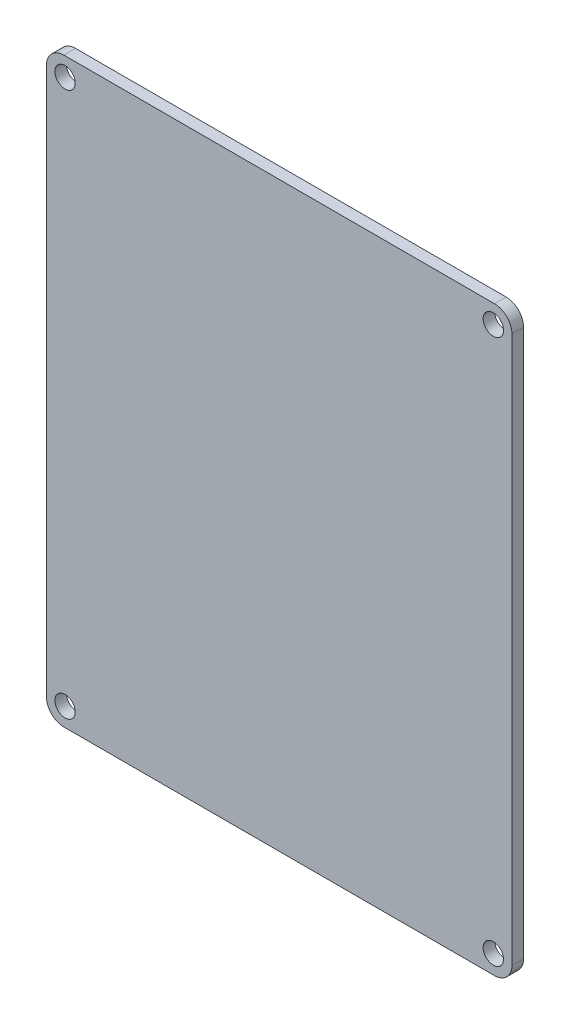
ISO-10303-21;
HEADER;
FILE_DESCRIPTION(('STEP AP214'),'2;1');
FILE_NAME('part.step','',(''),(''),'','','');
FILE_SCHEMA(('AUTOMOTIVE_DESIGN { 1 0 10303 214 1 1 1 1 }'));
ENDSEC;
DATA;
#1=APPLICATION_CONTEXT('core data for automotive mechanical design processes');
#2=APPLICATION_PROTOCOL_DEFINITION('international standard','automotive_design',2000,#1);
#3=PRODUCT_CONTEXT('',#1,'mechanical');
#4=PRODUCT('Part','Part','',(#3));
#5=PRODUCT_RELATED_PRODUCT_CATEGORY('part','',(#4));
#6=PRODUCT_DEFINITION_FORMATION('','',#4);
#7=PRODUCT_DEFINITION_CONTEXT('part definition',#1,'design');
#8=PRODUCT_DEFINITION('design','',#6,#7);
#9=PRODUCT_DEFINITION_SHAPE('','',#8);
#10=(LENGTH_UNIT() NAMED_UNIT(*) SI_UNIT(.MILLI.,.METRE.));
#11=(NAMED_UNIT(*) PLANE_ANGLE_UNIT() SI_UNIT($,.RADIAN.));
#12=(NAMED_UNIT(*) SI_UNIT($,.STERADIAN.) SOLID_ANGLE_UNIT());
#13=UNCERTAINTY_MEASURE_WITH_UNIT(LENGTH_MEASURE(1.E-05),#10,'distance_accuracy_value','');
#14=(GEOMETRIC_REPRESENTATION_CONTEXT(3) GLOBAL_UNCERTAINTY_ASSIGNED_CONTEXT((#13)) GLOBAL_UNIT_ASSIGNED_CONTEXT((#10,
#11,#12)) REPRESENTATION_CONTEXT('',''));
#15=CARTESIAN_POINT('',(0.,0.,0.));
#16=DIRECTION('',(0.,0.,1.));
#17=DIRECTION('',(1.,0.,0.));
#18=AXIS2_PLACEMENT_3D('',#15,#16,#17);
#19=CARTESIAN_POINT('',(37.,-47.,-2.));
#20=DIRECTION('',(0.,0.,1.));
#21=DIRECTION('',(1.,0.,0.));
#22=AXIS2_PLACEMENT_3D('',#19,#20,#21);
#23=CYLINDRICAL_SURFACE('',#22,3.);
#24=CARTESIAN_POINT('',(37.,-47.,0.));
#25=DIRECTION('',(0.,0.,1.));
#26=DIRECTION('',(1.,0.,0.));
#27=AXIS2_PLACEMENT_3D('',#24,#25,#26);
#28=CIRCLE('',#27,3.);
#29=CARTESIAN_POINT('',(37.,-50.,0.));
#30=VERTEX_POINT('',#29);
#31=CARTESIAN_POINT('',(40.,-47.,0.));
#32=VERTEX_POINT('',#31);
#33=EDGE_CURVE('E136',#30,#32,#28,.T.);
#34=ORIENTED_EDGE('',*,*,#33,.F.);
#35=DIRECTION('',(0.,0.,1.));
#36=VECTOR('',#35,1.);
#37=CARTESIAN_POINT('',(37.,-50.,-2.));
#38=LINE('',#37,#36);
#39=CARTESIAN_POINT('',(37.,-50.,-2.));
#40=VERTEX_POINT('',#39);
#41=EDGE_CURVE('E11',#40,#30,#38,.T.);
#42=ORIENTED_EDGE('',*,*,#41,.F.);
#43=CARTESIAN_POINT('',(37.,-47.,-2.));
#44=DIRECTION('',(0.,0.,1.));
#45=DIRECTION('',(1.,0.,0.));
#46=AXIS2_PLACEMENT_3D('',#43,#44,#45);
#47=CIRCLE('',#46,3.);
#48=CARTESIAN_POINT('',(40.,-47.,-2.));
#49=VERTEX_POINT('',#48);
#50=EDGE_CURVE('E157',#40,#49,#47,.T.);
#51=ORIENTED_EDGE('',*,*,#50,.T.);
#52=DIRECTION('',(0.,0.,1.));
#53=VECTOR('',#52,1.);
#54=CARTESIAN_POINT('',(40.,-47.,-2.));
#55=LINE('',#54,#53);
#56=EDGE_CURVE('E42',#49,#32,#55,.T.);
#57=ORIENTED_EDGE('',*,*,#56,.T.);
#58=EDGE_LOOP('',(#34,#42,#51,#57));
#59=FACE_BOUND('',#58,.T.);
#60=ADVANCED_FACE('F39',(#59),#23,.T.);
#61=CARTESIAN_POINT('',(-37.,-50.,-2.));
#62=DIRECTION('',(0.,-1.,0.));
#63=DIRECTION('',(0.,0.,-1.));
#64=AXIS2_PLACEMENT_3D('',#61,#62,#63);
#65=PLANE('',#64);
#66=DIRECTION('',(1.,0.,0.));
#67=VECTOR('',#66,1.);
#68=CARTESIAN_POINT('',(-37.,-50.,0.));
#69=LINE('',#68,#67);
#70=CARTESIAN_POINT('',(-37.,-50.,0.));
#71=VERTEX_POINT('',#70);
#72=EDGE_CURVE('E155',#71,#30,#69,.T.);
#73=ORIENTED_EDGE('',*,*,#72,.F.);
#74=DIRECTION('',(0.,0.,1.));
#75=VECTOR('',#74,1.);
#76=CARTESIAN_POINT('',(-37.,-50.,-2.));
#77=LINE('',#76,#75);
#78=CARTESIAN_POINT('',(-37.,-50.,-2.));
#79=VERTEX_POINT('',#78);
#80=EDGE_CURVE('E48',#79,#71,#77,.T.);
#81=ORIENTED_EDGE('',*,*,#80,.F.);
#82=DIRECTION('',(1.,0.,0.));
#83=VECTOR('',#82,1.);
#84=CARTESIAN_POINT('',(-37.,-50.,-2.));
#85=LINE('',#84,#83);
#86=EDGE_CURVE('E126',#79,#40,#85,.T.);
#87=ORIENTED_EDGE('',*,*,#86,.T.);
#88=ORIENTED_EDGE('',*,*,#41,.T.);
#89=EDGE_LOOP('',(#73,#81,#87,#88));
#90=FACE_BOUND('',#89,.T.);
#91=ADVANCED_FACE('F169',(#90),#65,.T.);
#92=CARTESIAN_POINT('',(-37.,-47.,-2.));
#93=DIRECTION('',(0.,0.,1.));
#94=DIRECTION('',(1.,0.,0.));
#95=AXIS2_PLACEMENT_3D('',#92,#93,#94);
#96=CYLINDRICAL_SURFACE('',#95,3.);
#97=CARTESIAN_POINT('',(-37.,-47.,0.));
#98=DIRECTION('',(0.,0.,1.));
#99=DIRECTION('',(1.,0.,0.));
#100=AXIS2_PLACEMENT_3D('',#97,#98,#99);
#101=CIRCLE('',#100,3.);
#102=CARTESIAN_POINT('',(-40.,-47.,0.));
#103=VERTEX_POINT('',#102);
#104=EDGE_CURVE('E113',#103,#71,#101,.T.);
#105=ORIENTED_EDGE('',*,*,#104,.F.);
#106=DIRECTION('',(0.,0.,1.));
#107=VECTOR('',#106,1.);
#108=CARTESIAN_POINT('',(-40.,-47.,-2.));
#109=LINE('',#108,#107);
#110=CARTESIAN_POINT('',(-40.,-47.,-2.));
#111=VERTEX_POINT('',#110);
#112=EDGE_CURVE('E108',#111,#103,#109,.T.);
#113=ORIENTED_EDGE('',*,*,#112,.F.);
#114=CARTESIAN_POINT('',(-37.,-47.,-2.));
#115=DIRECTION('',(0.,0.,1.));
#116=DIRECTION('',(1.,0.,0.));
#117=AXIS2_PLACEMENT_3D('',#114,#115,#116);
#118=CIRCLE('',#117,3.);
#119=EDGE_CURVE('E111',#111,#79,#118,.T.);
#120=ORIENTED_EDGE('',*,*,#119,.T.);
#121=ORIENTED_EDGE('',*,*,#80,.T.);
#122=EDGE_LOOP('',(#105,#113,#120,#121));
#123=FACE_BOUND('',#122,.T.);
#124=ADVANCED_FACE('F110',(#123),#96,.T.);
#125=CARTESIAN_POINT('',(-40.,47.,-2.));
#126=DIRECTION('',(-1.,0.,0.));
#127=DIRECTION('',(0.,-1.,0.));
#128=AXIS2_PLACEMENT_3D('',#125,#126,#127);
#129=PLANE('',#128);
#130=DIRECTION('',(0.,-1.,0.));
#131=VECTOR('',#130,1.);
#132=CARTESIAN_POINT('',(-40.,47.,0.));
#133=LINE('',#132,#131);
#134=CARTESIAN_POINT('',(-40.,47.,0.));
#135=VERTEX_POINT('',#134);
#136=EDGE_CURVE('E152',#135,#103,#133,.T.);
#137=ORIENTED_EDGE('',*,*,#136,.F.);
#138=DIRECTION('',(0.,0.,1.));
#139=VECTOR('',#138,1.);
#140=CARTESIAN_POINT('',(-40.,47.,-2.));
#141=LINE('',#140,#139);
#142=CARTESIAN_POINT('',(-40.,47.,-2.));
#143=VERTEX_POINT('',#142);
#144=EDGE_CURVE('E118',#143,#135,#141,.T.);
#145=ORIENTED_EDGE('',*,*,#144,.F.);
#146=DIRECTION('',(0.,-1.,0.));
#147=VECTOR('',#146,1.);
#148=CARTESIAN_POINT('',(-40.,47.,-2.));
#149=LINE('',#148,#147);
#150=EDGE_CURVE('E124',#143,#111,#149,.T.);
#151=ORIENTED_EDGE('',*,*,#150,.T.);
#152=ORIENTED_EDGE('',*,*,#112,.T.);
#153=EDGE_LOOP('',(#137,#145,#151,#152));
#154=FACE_BOUND('',#153,.T.);
#155=ADVANCED_FACE('F128',(#154),#129,.T.);
#156=CARTESIAN_POINT('',(-37.,47.,-2.));
#157=DIRECTION('',(0.,0.,1.));
#158=DIRECTION('',(1.,0.,0.));
#159=AXIS2_PLACEMENT_3D('',#156,#157,#158);
#160=CYLINDRICAL_SURFACE('',#159,3.);
#161=CARTESIAN_POINT('',(-37.,47.,0.));
#162=DIRECTION('',(0.,0.,1.));
#163=DIRECTION('',(1.,0.,0.));
#164=AXIS2_PLACEMENT_3D('',#161,#162,#163);
#165=CIRCLE('',#164,3.);
#166=CARTESIAN_POINT('',(-37.,50.,0.));
#167=VERTEX_POINT('',#166);
#168=EDGE_CURVE('E149',#167,#135,#165,.T.);
#169=ORIENTED_EDGE('',*,*,#168,.F.);
#170=DIRECTION('',(0.,0.,1.));
#171=VECTOR('',#170,1.);
#172=CARTESIAN_POINT('',(-37.,50.,-2.));
#173=LINE('',#172,#171);
#174=CARTESIAN_POINT('',(-37.,50.,-2.));
#175=VERTEX_POINT('',#174);
#176=EDGE_CURVE('E161',#175,#167,#173,.T.);
#177=ORIENTED_EDGE('',*,*,#176,.F.);
#178=CARTESIAN_POINT('',(-37.,47.,-2.));
#179=DIRECTION('',(0.,0.,1.));
#180=DIRECTION('',(1.,0.,0.));
#181=AXIS2_PLACEMENT_3D('',#178,#179,#180);
#182=CIRCLE('',#181,3.);
#183=EDGE_CURVE('E129',#175,#143,#182,.T.);
#184=ORIENTED_EDGE('',*,*,#183,.T.);
#185=ORIENTED_EDGE('',*,*,#144,.T.);
#186=EDGE_LOOP('',(#169,#177,#184,#185));
#187=FACE_BOUND('',#186,.T.);
#188=ADVANCED_FACE('F182',(#187),#160,.T.);
#189=CARTESIAN_POINT('',(-37.,50.,-2.));
#190=DIRECTION('',(0.,1.,0.));
#191=DIRECTION('',(0.,0.,1.));
#192=AXIS2_PLACEMENT_3D('',#189,#190,#191);
#193=PLANE('',#192);
#194=DIRECTION('',(-1.,0.,0.));
#195=VECTOR('',#194,1.);
#196=CARTESIAN_POINT('',(-37.,50.,0.));
#197=LINE('',#196,#195);
#198=CARTESIAN_POINT('',(37.,50.,0.));
#199=VERTEX_POINT('',#198);
#200=EDGE_CURVE('E146',#199,#167,#197,.T.);
#201=ORIENTED_EDGE('',*,*,#200,.F.);
#202=DIRECTION('',(0.,0.,1.));
#203=VECTOR('',#202,1.);
#204=CARTESIAN_POINT('',(37.,50.,-2.));
#205=LINE('',#204,#203);
#206=CARTESIAN_POINT('',(37.,50.,-2.));
#207=VERTEX_POINT('',#206);
#208=EDGE_CURVE('E163',#207,#199,#205,.T.);
#209=ORIENTED_EDGE('',*,*,#208,.F.);
#210=DIRECTION('',(-1.,0.,0.));
#211=VECTOR('',#210,1.);
#212=CARTESIAN_POINT('',(-37.,50.,-2.));
#213=LINE('',#212,#211);
#214=EDGE_CURVE('E131',#207,#175,#213,.T.);
#215=ORIENTED_EDGE('',*,*,#214,.T.);
#216=ORIENTED_EDGE('',*,*,#176,.T.);
#217=EDGE_LOOP('',(#201,#209,#215,#216));
#218=FACE_BOUND('',#217,.T.);
#219=ADVANCED_FACE('F185',(#218),#193,.T.);
#220=CARTESIAN_POINT('',(37.,47.,-2.));
#221=DIRECTION('',(0.,0.,1.));
#222=DIRECTION('',(1.,0.,0.));
#223=AXIS2_PLACEMENT_3D('',#220,#221,#222);
#224=CYLINDRICAL_SURFACE('',#223,3.);
#225=CARTESIAN_POINT('',(37.,47.,0.));
#226=DIRECTION('',(0.,0.,1.));
#227=DIRECTION('',(-1.,0.,0.));
#228=AXIS2_PLACEMENT_3D('',#225,#226,#227);
#229=CIRCLE('',#228,3.);
#230=CARTESIAN_POINT('',(40.,47.,0.));
#231=VERTEX_POINT('',#230);
#232=EDGE_CURVE('E143',#231,#199,#229,.T.);
#233=ORIENTED_EDGE('',*,*,#232,.F.);
#234=DIRECTION('',(0.,0.,1.));
#235=VECTOR('',#234,1.);
#236=CARTESIAN_POINT('',(40.,47.,-2.));
#237=LINE('',#236,#235);
#238=CARTESIAN_POINT('',(40.,47.,-2.));
#239=VERTEX_POINT('',#238);
#240=EDGE_CURVE('E164',#239,#231,#237,.T.);
#241=ORIENTED_EDGE('',*,*,#240,.F.);
#242=CARTESIAN_POINT('',(37.,47.,-2.));
#243=DIRECTION('',(0.,0.,1.));
#244=DIRECTION('',(-1.,0.,0.));
#245=AXIS2_PLACEMENT_3D('',#242,#243,#244);
#246=CIRCLE('',#245,3.);
#247=EDGE_CURVE('E252',#239,#207,#246,.T.);
#248=ORIENTED_EDGE('',*,*,#247,.T.);
#249=ORIENTED_EDGE('',*,*,#208,.T.);
#250=EDGE_LOOP('',(#233,#241,#248,#249));
#251=FACE_BOUND('',#250,.T.);
#252=ADVANCED_FACE('F189',(#251),#224,.T.);
#253=CARTESIAN_POINT('',(40.,47.,-2.));
#254=DIRECTION('',(1.,0.,0.));
#255=DIRECTION('',(0.,1.,0.));
#256=AXIS2_PLACEMENT_3D('',#253,#254,#255);
#257=PLANE('',#256);
#258=DIRECTION('',(0.,1.,0.));
#259=VECTOR('',#258,1.);
#260=CARTESIAN_POINT('',(40.,47.,0.));
#261=LINE('',#260,#259);
#262=EDGE_CURVE('E139',#32,#231,#261,.T.);
#263=ORIENTED_EDGE('',*,*,#262,.F.);
#264=ORIENTED_EDGE('',*,*,#56,.F.);
#265=DIRECTION('',(0.,1.,0.));
#266=VECTOR('',#265,1.);
#267=CARTESIAN_POINT('',(40.,47.,-2.));
#268=LINE('',#267,#266);
#269=EDGE_CURVE('E250',#49,#239,#268,.T.);
#270=ORIENTED_EDGE('',*,*,#269,.T.);
#271=ORIENTED_EDGE('',*,*,#240,.T.);
#272=EDGE_LOOP('',(#263,#264,#270,#271));
#273=FACE_BOUND('',#272,.T.);
#274=ADVANCED_FACE('F166',(#273),#257,.T.);
#275=CARTESIAN_POINT('',(37.,-47.,-2.));
#276=DIRECTION('',(0.,0.,1.));
#277=DIRECTION('',(1.,0.,0.));
#278=AXIS2_PLACEMENT_3D('',#275,#276,#277);
#279=PLANE('',#278);
#280=CARTESIAN_POINT('',(36.8,46.8,-2.));
#281=DIRECTION('',(0.,0.,1.));
#282=DIRECTION('',(1.,0.,0.));
#283=AXIS2_PLACEMENT_3D('',#280,#281,#282);
#284=CIRCLE('',#283,1.75);
#285=CARTESIAN_POINT('',(38.55,46.8,-2.));
#286=VERTEX_POINT('',#285);
#287=EDGE_CURVE('E240',#286,#286,#284,.T.);
#288=ORIENTED_EDGE('',*,*,#287,.T.);
#289=EDGE_LOOP('',(#288));
#290=FACE_BOUND('',#289,.T.);
#291=CARTESIAN_POINT('',(36.8,-46.8,-2.));
#292=DIRECTION('',(0.,0.,1.));
#293=DIRECTION('',(1.,0.,0.));
#294=AXIS2_PLACEMENT_3D('',#291,#292,#293);
#295=CIRCLE('',#294,1.75);
#296=CARTESIAN_POINT('',(38.55,-46.8,-2.));
#297=VERTEX_POINT('',#296);
#298=EDGE_CURVE('E230',#297,#297,#295,.T.);
#299=ORIENTED_EDGE('',*,*,#298,.T.);
#300=EDGE_LOOP('',(#299));
#301=FACE_BOUND('',#300,.T.);
#302=CARTESIAN_POINT('',(-36.8,-46.8,-2.));
#303=DIRECTION('',(0.,0.,1.));
#304=DIRECTION('',(1.,0.,0.));
#305=AXIS2_PLACEMENT_3D('',#302,#303,#304);
#306=CIRCLE('',#305,1.75);
#307=CARTESIAN_POINT('',(-35.05,-46.8,-2.));
#308=VERTEX_POINT('',#307);
#309=EDGE_CURVE('E225',#308,#308,#306,.T.);
#310=ORIENTED_EDGE('',*,*,#309,.T.);
#311=EDGE_LOOP('',(#310));
#312=FACE_BOUND('',#311,.T.);
#313=CARTESIAN_POINT('',(-36.8,46.8,-2.));
#314=DIRECTION('',(0.,0.,1.));
#315=DIRECTION('',(1.,0.,0.));
#316=AXIS2_PLACEMENT_3D('',#313,#314,#315);
#317=CIRCLE('',#316,1.75);
#318=CARTESIAN_POINT('',(-35.05,46.8,-2.));
#319=VERTEX_POINT('',#318);
#320=EDGE_CURVE('E140',#319,#319,#317,.T.);
#321=ORIENTED_EDGE('',*,*,#320,.T.);
#322=EDGE_LOOP('',(#321));
#323=FACE_BOUND('',#322,.T.);
#324=ORIENTED_EDGE('',*,*,#50,.F.);
#325=ORIENTED_EDGE('',*,*,#86,.F.);
#326=ORIENTED_EDGE('',*,*,#119,.F.);
#327=ORIENTED_EDGE('',*,*,#150,.F.);
#328=ORIENTED_EDGE('',*,*,#183,.F.);
#329=ORIENTED_EDGE('',*,*,#214,.F.);
#330=ORIENTED_EDGE('',*,*,#247,.F.);
#331=ORIENTED_EDGE('',*,*,#269,.F.);
#332=EDGE_LOOP('',(#324,#325,#326,#327,#328,#329,#330,#331));
#333=FACE_BOUND('',#332,.T.);
#334=ADVANCED_FACE('F122',(#290,#301,#312,#323,#333),#279,.F.);
#335=CARTESIAN_POINT('',(37.,-47.,0.));
#336=DIRECTION('',(0.,0.,1.));
#337=DIRECTION('',(1.,0.,0.));
#338=AXIS2_PLACEMENT_3D('',#335,#336,#337);
#339=PLANE('',#338);
#340=CARTESIAN_POINT('',(36.8,46.8,0.));
#341=DIRECTION('',(0.,0.,1.));
#342=DIRECTION('',(1.,0.,0.));
#343=AXIS2_PLACEMENT_3D('',#340,#341,#342);
#344=CIRCLE('',#343,1.75);
#345=CARTESIAN_POINT('',(38.55,46.8,0.));
#346=VERTEX_POINT('',#345);
#347=EDGE_CURVE('E242',#346,#346,#344,.T.);
#348=ORIENTED_EDGE('',*,*,#347,.F.);
#349=EDGE_LOOP('',(#348));
#350=FACE_BOUND('',#349,.T.);
#351=CARTESIAN_POINT('',(36.8,-46.8,0.));
#352=DIRECTION('',(0.,0.,1.));
#353=DIRECTION('',(1.,0.,0.));
#354=AXIS2_PLACEMENT_3D('',#351,#352,#353);
#355=CIRCLE('',#354,1.75);
#356=CARTESIAN_POINT('',(38.55,-46.8,0.));
#357=VERTEX_POINT('',#356);
#358=EDGE_CURVE('E235',#357,#357,#355,.T.);
#359=ORIENTED_EDGE('',*,*,#358,.F.);
#360=EDGE_LOOP('',(#359));
#361=FACE_BOUND('',#360,.T.);
#362=CARTESIAN_POINT('',(-36.8,-46.8,0.));
#363=DIRECTION('',(0.,0.,1.));
#364=DIRECTION('',(1.,0.,0.));
#365=AXIS2_PLACEMENT_3D('',#362,#363,#364);
#366=CIRCLE('',#365,1.75);
#367=CARTESIAN_POINT('',(-35.05,-46.8,0.));
#368=VERTEX_POINT('',#367);
#369=EDGE_CURVE('E228',#368,#368,#366,.T.);
#370=ORIENTED_EDGE('',*,*,#369,.F.);
#371=EDGE_LOOP('',(#370));
#372=FACE_BOUND('',#371,.T.);
#373=CARTESIAN_POINT('',(-36.8,46.8,0.));
#374=DIRECTION('',(0.,0.,1.));
#375=DIRECTION('',(1.,0.,0.));
#376=AXIS2_PLACEMENT_3D('',#373,#374,#375);
#377=CIRCLE('',#376,1.75);
#378=CARTESIAN_POINT('',(-35.05,46.8,0.));
#379=VERTEX_POINT('',#378);
#380=EDGE_CURVE('E232',#379,#379,#377,.T.);
#381=ORIENTED_EDGE('',*,*,#380,.F.);
#382=EDGE_LOOP('',(#381));
#383=FACE_BOUND('',#382,.T.);
#384=ORIENTED_EDGE('',*,*,#33,.T.);
#385=ORIENTED_EDGE('',*,*,#262,.T.);
#386=ORIENTED_EDGE('',*,*,#232,.T.);
#387=ORIENTED_EDGE('',*,*,#200,.T.);
#388=ORIENTED_EDGE('',*,*,#168,.T.);
#389=ORIENTED_EDGE('',*,*,#136,.T.);
#390=ORIENTED_EDGE('',*,*,#104,.T.);
#391=ORIENTED_EDGE('',*,*,#72,.T.);
#392=EDGE_LOOP('',(#384,#385,#386,#387,#388,#389,#390,#391));
#393=FACE_BOUND('',#392,.T.);
#394=ADVANCED_FACE('F168',(#350,#361,#372,#383,#393),#339,.T.);
#395=CARTESIAN_POINT('',(-36.8,46.8,-2.));
#396=DIRECTION('',(0.,0.,1.));
#397=DIRECTION('',(1.,0.,0.));
#398=AXIS2_PLACEMENT_3D('',#395,#396,#397);
#399=CYLINDRICAL_SURFACE('',#398,1.75);
#400=ORIENTED_EDGE('',*,*,#320,.F.);
#401=EDGE_LOOP('',(#400));
#402=FACE_BOUND('',#401,.T.);
#403=ORIENTED_EDGE('',*,*,#380,.T.);
#404=EDGE_LOOP('',(#403));
#405=FACE_BOUND('',#404,.T.);
#406=ADVANCED_FACE('F201',(#402,#405),#399,.F.);
#407=CARTESIAN_POINT('',(-36.8,-46.8,-2.));
#408=DIRECTION('',(0.,0.,1.));
#409=DIRECTION('',(1.,0.,0.));
#410=AXIS2_PLACEMENT_3D('',#407,#408,#409);
#411=CYLINDRICAL_SURFACE('',#410,1.75);
#412=ORIENTED_EDGE('',*,*,#309,.F.);
#413=EDGE_LOOP('',(#412));
#414=FACE_BOUND('',#413,.T.);
#415=ORIENTED_EDGE('',*,*,#369,.T.);
#416=EDGE_LOOP('',(#415));
#417=FACE_BOUND('',#416,.T.);
#418=ADVANCED_FACE('F208',(#414,#417),#411,.F.);
#419=CARTESIAN_POINT('',(36.8,-46.8,-2.));
#420=DIRECTION('',(0.,0.,1.));
#421=DIRECTION('',(1.,0.,0.));
#422=AXIS2_PLACEMENT_3D('',#419,#420,#421);
#423=CYLINDRICAL_SURFACE('',#422,1.75);
#424=ORIENTED_EDGE('',*,*,#298,.F.);
#425=EDGE_LOOP('',(#424));
#426=FACE_BOUND('',#425,.T.);
#427=ORIENTED_EDGE('',*,*,#358,.T.);
#428=EDGE_LOOP('',(#427));
#429=FACE_BOUND('',#428,.T.);
#430=ADVANCED_FACE('F213',(#426,#429),#423,.F.);
#431=CARTESIAN_POINT('',(36.8,46.8,-2.));
#432=DIRECTION('',(0.,0.,1.));
#433=DIRECTION('',(1.,0.,0.));
#434=AXIS2_PLACEMENT_3D('',#431,#432,#433);
#435=CYLINDRICAL_SURFACE('',#434,1.75);
#436=ORIENTED_EDGE('',*,*,#287,.F.);
#437=EDGE_LOOP('',(#436));
#438=FACE_BOUND('',#437,.T.);
#439=ORIENTED_EDGE('',*,*,#347,.T.);
#440=EDGE_LOOP('',(#439));
#441=FACE_BOUND('',#440,.T.);
#442=ADVANCED_FACE('F210',(#438,#441),#435,.F.);
#443=CLOSED_SHELL('',(#60,#91,#124,#155,#188,#219,#252,#274,#334,#394,#406,#418,#430,#442));
#444=MANIFOLD_SOLID_BREP('B2',#443);
#445=ADVANCED_BREP_SHAPE_REPRESENTATION('',(#18,#444),#14);
#446=SHAPE_DEFINITION_REPRESENTATION(#9,#445);
ENDSEC;
END-ISO-10303-21;
